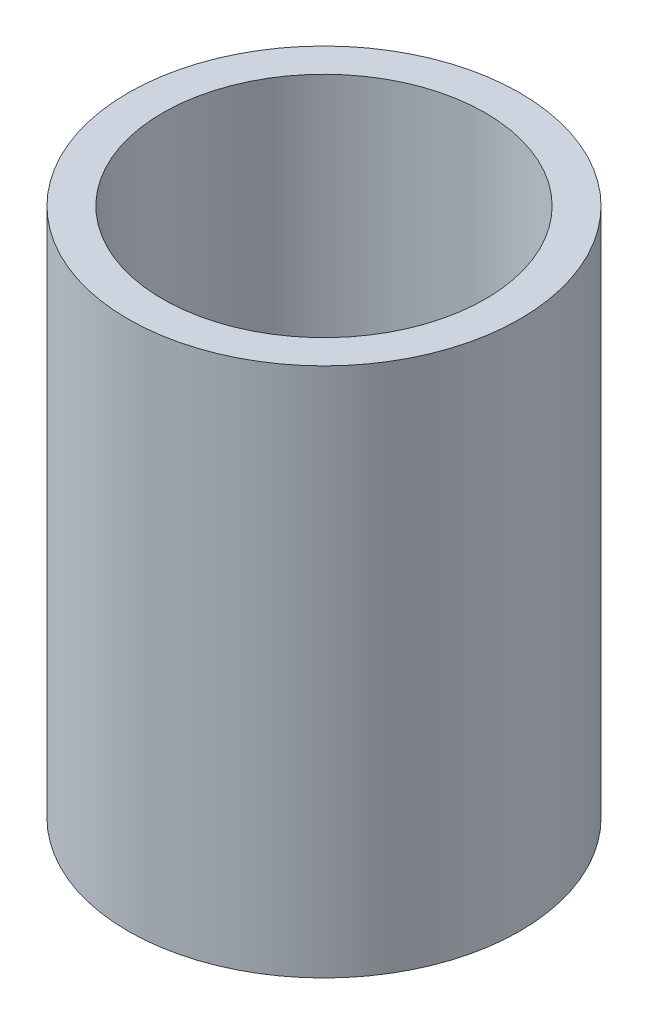
ISO-10303-21;
HEADER;
FILE_DESCRIPTION(('STEP AP214'),'2;1');
FILE_NAME('part.step','',(''),(''),'','','');
FILE_SCHEMA(('AUTOMOTIVE_DESIGN { 1 0 10303 214 1 1 1 1 }'));
ENDSEC;
DATA;
#1=APPLICATION_CONTEXT('core data for automotive mechanical design processes');
#2=APPLICATION_PROTOCOL_DEFINITION('international standard','automotive_design',2000,#1);
#3=PRODUCT_CONTEXT('',#1,'mechanical');
#4=PRODUCT('Part','Part','',(#3));
#5=PRODUCT_RELATED_PRODUCT_CATEGORY('part','',(#4));
#6=PRODUCT_DEFINITION_FORMATION('','',#4);
#7=PRODUCT_DEFINITION_CONTEXT('part definition',#1,'design');
#8=PRODUCT_DEFINITION('design','',#6,#7);
#9=PRODUCT_DEFINITION_SHAPE('','',#8);
#10=(LENGTH_UNIT() NAMED_UNIT(*) SI_UNIT(.MILLI.,.METRE.));
#11=(NAMED_UNIT(*) PLANE_ANGLE_UNIT() SI_UNIT($,.RADIAN.));
#12=(NAMED_UNIT(*) SI_UNIT($,.STERADIAN.) SOLID_ANGLE_UNIT());
#13=UNCERTAINTY_MEASURE_WITH_UNIT(LENGTH_MEASURE(1.E-05),#10,'distance_accuracy_value','');
#14=(GEOMETRIC_REPRESENTATION_CONTEXT(3) GLOBAL_UNCERTAINTY_ASSIGNED_CONTEXT((#13)) GLOBAL_UNIT_ASSIGNED_CONTEXT((#10,
#11,#12)) REPRESENTATION_CONTEXT('',''));
#15=CARTESIAN_POINT('',(0.,0.,0.));
#16=DIRECTION('',(0.,0.,1.));
#17=DIRECTION('',(1.,0.,0.));
#18=AXIS2_PLACEMENT_3D('',#15,#16,#17);
#19=CARTESIAN_POINT('',(7.,0.,0.));
#20=DIRECTION('',(0.,-1.,0.));
#21=DIRECTION('',(0.,0.,-1.));
#22=AXIS2_PLACEMENT_3D('',#19,#20,#21);
#23=PLANE('',#22);
#24=CARTESIAN_POINT('',(0.,0.,0.));
#25=DIRECTION('',(0.,-1.,0.));
#26=DIRECTION('',(0.,0.,-1.));
#27=AXIS2_PLACEMENT_3D('',#24,#25,#26);
#28=CIRCLE('',#27,8.5);
#29=CARTESIAN_POINT('',(0.,0.,-8.5));
#30=VERTEX_POINT('',#29);
#31=EDGE_CURVE('E11',#30,#30,#28,.T.);
#32=ORIENTED_EDGE('',*,*,#31,.T.);
#33=EDGE_LOOP('',(#32));
#34=FACE_BOUND('',#33,.T.);
#35=CARTESIAN_POINT('',(0.,0.,0.));
#36=DIRECTION('',(0.,-1.,0.));
#37=DIRECTION('',(0.,0.,-1.));
#38=AXIS2_PLACEMENT_3D('',#35,#36,#37);
#39=CIRCLE('',#38,7.);
#40=CARTESIAN_POINT('',(0.,0.,-7.));
#41=VERTEX_POINT('',#40);
#42=EDGE_CURVE('E65',#41,#41,#39,.T.);
#43=ORIENTED_EDGE('',*,*,#42,.F.);
#44=EDGE_LOOP('',(#43));
#45=FACE_BOUND('',#44,.T.);
#46=ADVANCED_FACE('F34',(#34,#45),#23,.T.);
#47=CARTESIAN_POINT('',(0.,0.,0.));
#48=DIRECTION('',(0.,-1.,0.));
#49=DIRECTION('',(0.,0.,-1.));
#50=AXIS2_PLACEMENT_3D('',#47,#48,#49);
#51=CYLINDRICAL_SURFACE('',#50,8.5);
#52=CARTESIAN_POINT('',(0.,23.,0.));
#53=DIRECTION('',(0.,-1.,0.));
#54=DIRECTION('',(0.,0.,-1.));
#55=AXIS2_PLACEMENT_3D('',#52,#53,#54);
#56=CIRCLE('',#55,8.49999999999999);
#57=CARTESIAN_POINT('',(0.,23.,-8.49999999999999));
#58=VERTEX_POINT('',#57);
#59=EDGE_CURVE('E41',#58,#58,#56,.T.);
#60=ORIENTED_EDGE('',*,*,#59,.T.);
#61=EDGE_LOOP('',(#60));
#62=FACE_BOUND('',#61,.T.);
#63=ORIENTED_EDGE('',*,*,#31,.F.);
#64=EDGE_LOOP('',(#63));
#65=FACE_BOUND('',#64,.T.);
#66=ADVANCED_FACE('F76',(#62,#65),#51,.T.);
#67=CARTESIAN_POINT('',(8.49999999999999,23.,0.));
#68=DIRECTION('',(0.,1.,0.));
#69=DIRECTION('',(0.,0.,1.));
#70=AXIS2_PLACEMENT_3D('',#67,#68,#69);
#71=PLANE('',#70);
#72=CARTESIAN_POINT('',(0.,23.,0.));
#73=DIRECTION('',(0.,-1.,0.));
#74=DIRECTION('',(0.,0.,-1.));
#75=AXIS2_PLACEMENT_3D('',#72,#73,#74);
#76=CIRCLE('',#75,7.);
#77=CARTESIAN_POINT('',(0.,23.,-7.));
#78=VERTEX_POINT('',#77);
#79=EDGE_CURVE('E62',#78,#78,#76,.T.);
#80=ORIENTED_EDGE('',*,*,#79,.T.);
#81=EDGE_LOOP('',(#80));
#82=FACE_BOUND('',#81,.T.);
#83=ORIENTED_EDGE('',*,*,#59,.F.);
#84=EDGE_LOOP('',(#83));
#85=FACE_BOUND('',#84,.T.);
#86=ADVANCED_FACE('F79',(#82,#85),#71,.T.);
#87=CARTESIAN_POINT('',(0.,0.,0.));
#88=DIRECTION('',(0.,-1.,0.));
#89=DIRECTION('',(0.,0.,-1.));
#90=AXIS2_PLACEMENT_3D('',#87,#88,#89);
#91=CYLINDRICAL_SURFACE('',#90,7.);
#92=CARTESIAN_POINT('',(0.,12.,0.));
#93=DIRECTION('',(0.,-1.,0.));
#94=DIRECTION('',(0.,0.,-1.));
#95=AXIS2_PLACEMENT_3D('',#92,#93,#94);
#96=CIRCLE('',#95,7.);
#97=CARTESIAN_POINT('',(0.,12.,-7.));
#98=VERTEX_POINT('',#97);
#99=EDGE_CURVE('E55',#98,#98,#96,.T.);
#100=ORIENTED_EDGE('',*,*,#99,.T.);
#101=EDGE_LOOP('',(#100));
#102=FACE_BOUND('',#101,.T.);
#103=ORIENTED_EDGE('',*,*,#79,.F.);
#104=EDGE_LOOP('',(#103));
#105=FACE_BOUND('',#104,.T.);
#106=ADVANCED_FACE('F81',(#102,#105),#91,.F.);
#107=CARTESIAN_POINT('',(7.,12.,0.));
#108=DIRECTION('',(0.,1.,0.));
#109=DIRECTION('',(0.,0.,1.));
#110=AXIS2_PLACEMENT_3D('',#107,#108,#109);
#111=PLANE('',#110);
#112=CARTESIAN_POINT('',(0.,12.,0.));
#113=DIRECTION('',(0.,-1.,0.));
#114=DIRECTION('',(0.,0.,-1.));
#115=AXIS2_PLACEMENT_3D('',#112,#113,#114);
#116=CIRCLE('',#115,5.19615242270666);
#117=CARTESIAN_POINT('',(0.,12.,-5.19615242270666));
#118=VERTEX_POINT('',#117);
#119=EDGE_CURVE('E52',#118,#118,#116,.T.);
#120=ORIENTED_EDGE('',*,*,#119,.T.);
#121=EDGE_LOOP('',(#120));
#122=FACE_BOUND('',#121,.T.);
#123=ORIENTED_EDGE('',*,*,#99,.F.);
#124=EDGE_LOOP('',(#123));
#125=FACE_BOUND('',#124,.T.);
#126=ADVANCED_FACE('F48',(#122,#125),#111,.T.);
#127=CARTESIAN_POINT('',(0.,12.,0.));
#128=DIRECTION('',(0.,1.,0.));
#129=DIRECTION('',(0.,0.,1.));
#130=AXIS2_PLACEMENT_3D('',#127,#128,#129);
#131=CONICAL_SURFACE('',#130,5.19615242270666,1.0471975511966);
#132=CARTESIAN_POINT('',(0.,9.,0.));
#133=VERTEX_POINT('',#132);
#134=VERTEX_LOOP('',#133);
#135=FACE_BOUND('',#134,.T.);
#136=ORIENTED_EDGE('',*,*,#119,.F.);
#137=EDGE_LOOP('',(#136));
#138=FACE_BOUND('',#137,.T.);
#139=ADVANCED_FACE('F44',(#135,#138),#131,.F.);
#140=CARTESIAN_POINT('',(7.,4.,0.));
#141=DIRECTION('',(0.,-1.,0.));
#142=DIRECTION('',(0.,0.,-1.));
#143=AXIS2_PLACEMENT_3D('',#140,#141,#142);
#144=PLANE('',#143);
#145=CARTESIAN_POINT('',(0.,4.,0.));
#146=DIRECTION('',(0.,-1.,0.));
#147=DIRECTION('',(0.,0.,-1.));
#148=AXIS2_PLACEMENT_3D('',#145,#146,#147);
#149=CIRCLE('',#148,7.);
#150=CARTESIAN_POINT('',(0.,4.,-7.));
#151=VERTEX_POINT('',#150);
#152=EDGE_CURVE('E56',#151,#151,#149,.T.);
#153=ORIENTED_EDGE('',*,*,#152,.T.);
#154=EDGE_LOOP('',(#153));
#155=FACE_BOUND('',#154,.T.);
#156=ADVANCED_FACE('F47',(#155),#144,.T.);
#157=CARTESIAN_POINT('',(0.,0.,0.));
#158=DIRECTION('',(0.,-1.,0.));
#159=DIRECTION('',(0.,0.,-1.));
#160=AXIS2_PLACEMENT_3D('',#157,#158,#159);
#161=CYLINDRICAL_SURFACE('',#160,7.);
#162=ORIENTED_EDGE('',*,*,#42,.T.);
#163=EDGE_LOOP('',(#162));
#164=FACE_BOUND('',#163,.T.);
#165=ORIENTED_EDGE('',*,*,#152,.F.);
#166=EDGE_LOOP('',(#165));
#167=FACE_BOUND('',#166,.T.);
#168=ADVANCED_FACE('F102',(#164,#167),#161,.F.);
#169=CLOSED_SHELL('',(#46,#66,#86,#106,#126,#139,#156,#168));
#170=MANIFOLD_SOLID_BREP('B2',#169);
#171=ADVANCED_BREP_SHAPE_REPRESENTATION('',(#18,#170),#14);
#172=SHAPE_DEFINITION_REPRESENTATION(#9,#171);
ENDSEC;
END-ISO-10303-21;
